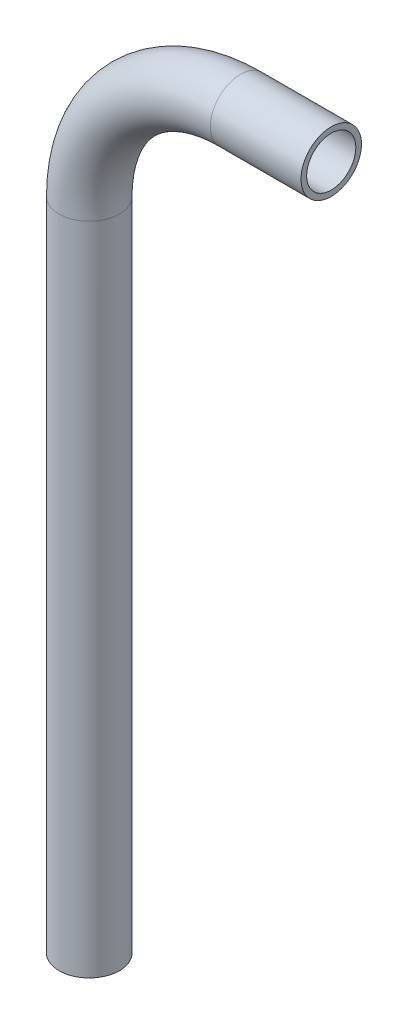
ISO-10303-21;
HEADER;
FILE_DESCRIPTION(('STEP AP214'),'2;1');
FILE_NAME('part.step','',(''),(''),'','','');
FILE_SCHEMA(('AUTOMOTIVE_DESIGN { 1 0 10303 214 1 1 1 1 }'));
ENDSEC;
DATA;
#1=APPLICATION_CONTEXT('core data for automotive mechanical design processes');
#2=APPLICATION_PROTOCOL_DEFINITION('international standard','automotive_design',2000,#1);
#3=PRODUCT_CONTEXT('',#1,'mechanical');
#4=PRODUCT('Part','Part','',(#3));
#5=PRODUCT_RELATED_PRODUCT_CATEGORY('part','',(#4));
#6=PRODUCT_DEFINITION_FORMATION('','',#4);
#7=PRODUCT_DEFINITION_CONTEXT('part definition',#1,'design');
#8=PRODUCT_DEFINITION('design','',#6,#7);
#9=PRODUCT_DEFINITION_SHAPE('','',#8);
#10=(LENGTH_UNIT() NAMED_UNIT(*) SI_UNIT(.MILLI.,.METRE.));
#11=(NAMED_UNIT(*) PLANE_ANGLE_UNIT() SI_UNIT($,.RADIAN.));
#12=(NAMED_UNIT(*) SI_UNIT($,.STERADIAN.) SOLID_ANGLE_UNIT());
#13=UNCERTAINTY_MEASURE_WITH_UNIT(LENGTH_MEASURE(1.E-05),#10,'distance_accuracy_value','');
#14=(GEOMETRIC_REPRESENTATION_CONTEXT(3) GLOBAL_UNCERTAINTY_ASSIGNED_CONTEXT((#13)) GLOBAL_UNIT_ASSIGNED_CONTEXT((#10,
#11,#12)) REPRESENTATION_CONTEXT('',''));
#15=CARTESIAN_POINT('',(0.,0.,0.));
#16=DIRECTION('',(0.,0.,1.));
#17=DIRECTION('',(1.,0.,0.));
#18=AXIS2_PLACEMENT_3D('',#15,#16,#17);
#19=CARTESIAN_POINT('',(0.,-127.,0.));
#20=DIRECTION('',(0.,1.,0.));
#21=DIRECTION('',(-1.,0.,0.));
#22=AXIS2_PLACEMENT_3D('',#19,#20,#21);
#23=CYLINDRICAL_SURFACE('',#22,4.7625);
#24=CARTESIAN_POINT('',(0.,-23.8125000000002,0.));
#25=DIRECTION('',(0.,1.,0.));
#26=DIRECTION('',(0.,0.,-1.));
#27=AXIS2_PLACEMENT_3D('',#24,#25,#26);
#28=CIRCLE('',#27,4.7625);
#29=CARTESIAN_POINT('',(-4.7625,-23.8125000000002,0.));
#30=VERTEX_POINT('',#29);
#31=EDGE_CURVE('E84',#30,#30,#28,.T.);
#32=ORIENTED_EDGE('',*,*,#31,.F.);
#33=EDGE_LOOP('',(#32));
#34=FACE_BOUND('',#33,.T.);
#35=CARTESIAN_POINT('',(0.,-127.,0.));
#36=DIRECTION('',(0.,1.,0.));
#37=DIRECTION('',(0.,0.,-1.));
#38=AXIS2_PLACEMENT_3D('',#35,#36,#37);
#39=CIRCLE('',#38,4.7625);
#40=CARTESIAN_POINT('',(0.,-127.,-4.7625));
#41=VERTEX_POINT('',#40);
#42=EDGE_CURVE('E53',#41,#41,#39,.T.);
#43=ORIENTED_EDGE('',*,*,#42,.T.);
#44=EDGE_LOOP('',(#43));
#45=FACE_BOUND('',#44,.T.);
#46=ADVANCED_FACE('F38',(#34,#45),#23,.T.);
#47=CARTESIAN_POINT('',(23.8125,-23.8125,0.));
#48=DIRECTION('',(0.,0.,-1.));
#49=DIRECTION('',(-1.,0.,0.));
#50=AXIS2_PLACEMENT_3D('',#47,#48,#49);
#51=TOROIDAL_SURFACE('',#50,23.8125,4.7625);
#52=CARTESIAN_POINT('',(23.8125000000002,2.66453525910038E-13,0.));
#53=DIRECTION('',(1.,0.,0.));
#54=DIRECTION('',(0.,0.,-1.));
#55=AXIS2_PLACEMENT_3D('',#52,#53,#54);
#56=CIRCLE('',#55,4.7625);
#57=CARTESIAN_POINT('',(23.8125000000002,4.7625,0.));
#58=VERTEX_POINT('',#57);
#59=EDGE_CURVE('E42',#58,#58,#56,.T.);
#60=CARTESIAN_POINT('',(23.8125,-23.8125,0.));
#61=DIRECTION('',(0.,0.,-1.));
#62=DIRECTION('',(-1.,0.,0.));
#63=AXIS2_PLACEMENT_3D('',#60,#61,#62);
#64=CIRCLE('',#63,28.575);
#65=EDGE_CURVE('',#30,#58,#64,.T.);
#66=ORIENTED_EDGE('',*,*,#31,.T.);
#67=ORIENTED_EDGE('',*,*,#59,.F.);
#68=ORIENTED_EDGE('',*,*,#65,.T.);
#69=ORIENTED_EDGE('',*,*,#65,.F.);
#70=EDGE_LOOP('',(#66,#68,#67,#69));
#71=FACE_BOUND('',#70,.T.);
#72=ADVANCED_FACE('F92',(#71),#51,.T.);
#73=CARTESIAN_POINT('',(23.8125000000002,0.,0.));
#74=DIRECTION('',(1.,0.,0.));
#75=DIRECTION('',(0.,0.,-1.));
#76=AXIS2_PLACEMENT_3D('',#73,#74,#75);
#77=CYLINDRICAL_SURFACE('',#76,4.7625);
#78=CARTESIAN_POINT('',(38.1,0.,0.));
#79=DIRECTION('',(1.,0.,0.));
#80=DIRECTION('',(0.,0.,-1.));
#81=AXIS2_PLACEMENT_3D('',#78,#79,#80);
#82=CIRCLE('',#81,4.7625);
#83=CARTESIAN_POINT('',(38.1,0.,-4.7625));
#84=VERTEX_POINT('',#83);
#85=EDGE_CURVE('E58',#84,#84,#82,.T.);
#86=ORIENTED_EDGE('',*,*,#85,.F.);
#87=EDGE_LOOP('',(#86));
#88=FACE_BOUND('',#87,.T.);
#89=ORIENTED_EDGE('',*,*,#59,.T.);
#90=EDGE_LOOP('',(#89));
#91=FACE_BOUND('',#90,.T.);
#92=ADVANCED_FACE('F40',(#88,#91),#77,.T.);
#93=CARTESIAN_POINT('',(0.,-127.,0.));
#94=DIRECTION('',(0.,1.,0.));
#95=DIRECTION('',(0.,0.,-1.));
#96=AXIS2_PLACEMENT_3D('',#93,#94,#95);
#97=PLANE('',#96);
#98=CARTESIAN_POINT('',(0.,-127.,0.));
#99=DIRECTION('',(0.,1.,0.));
#100=DIRECTION('',(0.,0.,-1.));
#101=AXIS2_PLACEMENT_3D('',#98,#99,#100);
#102=CIRCLE('',#101,3.8735);
#103=CARTESIAN_POINT('',(0.,-127.,-3.8735));
#104=VERTEX_POINT('',#103);
#105=EDGE_CURVE('E79',#104,#104,#102,.F.);
#106=ORIENTED_EDGE('',*,*,#105,.F.);
#107=EDGE_LOOP('',(#106));
#108=FACE_BOUND('',#107,.T.);
#109=ORIENTED_EDGE('',*,*,#42,.F.);
#110=EDGE_LOOP('',(#109));
#111=FACE_BOUND('',#110,.T.);
#112=ADVANCED_FACE('F98',(#108,#111),#97,.F.);
#113=CARTESIAN_POINT('',(38.1,0.,0.));
#114=DIRECTION('',(1.,0.,0.));
#115=DIRECTION('',(0.,0.,-1.));
#116=AXIS2_PLACEMENT_3D('',#113,#114,#115);
#117=PLANE('',#116);
#118=CARTESIAN_POINT('',(38.1,0.,0.));
#119=DIRECTION('',(1.,0.,0.));
#120=DIRECTION('',(0.,0.,-1.));
#121=AXIS2_PLACEMENT_3D('',#118,#119,#120);
#122=CIRCLE('',#121,3.8735);
#123=CARTESIAN_POINT('',(38.1,0.,-3.8735));
#124=VERTEX_POINT('',#123);
#125=EDGE_CURVE('E11',#124,#124,#122,.F.);
#126=ORIENTED_EDGE('',*,*,#125,.T.);
#127=EDGE_LOOP('',(#126));
#128=FACE_BOUND('',#127,.T.);
#129=ORIENTED_EDGE('',*,*,#85,.T.);
#130=EDGE_LOOP('',(#129));
#131=FACE_BOUND('',#130,.T.);
#132=ADVANCED_FACE('F65',(#128,#131),#117,.T.);
#133=CARTESIAN_POINT('',(0.,-127.,0.));
#134=DIRECTION('',(0.,1.,0.));
#135=DIRECTION('',(-1.,0.,0.));
#136=AXIS2_PLACEMENT_3D('',#133,#134,#135);
#137=CYLINDRICAL_SURFACE('',#136,3.8735);
#138=CARTESIAN_POINT('',(0.,-23.8125000000002,0.));
#139=DIRECTION('',(0.,1.,0.));
#140=DIRECTION('',(0.,0.,-1.));
#141=AXIS2_PLACEMENT_3D('',#138,#139,#140);
#142=CIRCLE('',#141,3.8735);
#143=CARTESIAN_POINT('',(-3.8735,-23.8125000000002,0.));
#144=VERTEX_POINT('',#143);
#145=EDGE_CURVE('E76',#144,#144,#142,.F.);
#146=ORIENTED_EDGE('',*,*,#145,.F.);
#147=EDGE_LOOP('',(#146));
#148=FACE_BOUND('',#147,.T.);
#149=ORIENTED_EDGE('',*,*,#105,.T.);
#150=EDGE_LOOP('',(#149));
#151=FACE_BOUND('',#150,.T.);
#152=ADVANCED_FACE('F106',(#148,#151),#137,.F.);
#153=CARTESIAN_POINT('',(23.8125,-23.8125,0.));
#154=DIRECTION('',(0.,0.,-1.));
#155=DIRECTION('',(-1.,0.,0.));
#156=AXIS2_PLACEMENT_3D('',#153,#154,#155);
#157=TOROIDAL_SURFACE('',#156,23.8125,3.8735);
#158=CARTESIAN_POINT('',(23.8125000000002,2.66453525910038E-13,0.));
#159=DIRECTION('',(1.,0.,0.));
#160=DIRECTION('',(0.,0.,-1.));
#161=AXIS2_PLACEMENT_3D('',#158,#159,#160);
#162=CIRCLE('',#161,3.8735);
#163=CARTESIAN_POINT('',(23.8125000000002,3.8735,0.));
#164=VERTEX_POINT('',#163);
#165=EDGE_CURVE('E47',#164,#164,#162,.F.);
#166=CARTESIAN_POINT('',(23.8125,-23.8125,0.));
#167=DIRECTION('',(0.,0.,-1.));
#168=DIRECTION('',(-1.,0.,0.));
#169=AXIS2_PLACEMENT_3D('',#166,#167,#168);
#170=CIRCLE('',#169,27.686);
#171=EDGE_CURVE('',#144,#164,#170,.T.);
#172=ORIENTED_EDGE('',*,*,#145,.T.);
#173=ORIENTED_EDGE('',*,*,#165,.F.);
#174=ORIENTED_EDGE('',*,*,#171,.T.);
#175=ORIENTED_EDGE('',*,*,#171,.F.);
#176=EDGE_LOOP('',(#172,#174,#173,#175));
#177=FACE_BOUND('',#176,.T.);
#178=ADVANCED_FACE('F71',(#177),#157,.F.);
#179=CARTESIAN_POINT('',(23.8125000000002,0.,0.));
#180=DIRECTION('',(1.,0.,0.));
#181=DIRECTION('',(0.,0.,-1.));
#182=AXIS2_PLACEMENT_3D('',#179,#180,#181);
#183=CYLINDRICAL_SURFACE('',#182,3.8735);
#184=ORIENTED_EDGE('',*,*,#125,.F.);
#185=EDGE_LOOP('',(#184));
#186=FACE_BOUND('',#185,.T.);
#187=ORIENTED_EDGE('',*,*,#165,.T.);
#188=EDGE_LOOP('',(#187));
#189=FACE_BOUND('',#188,.T.);
#190=ADVANCED_FACE('F68',(#186,#189),#183,.F.);
#191=CLOSED_SHELL('',(#46,#72,#92,#112,#132,#152,#178,#190));
#192=MANIFOLD_SOLID_BREP('B2',#191);
#193=ADVANCED_BREP_SHAPE_REPRESENTATION('',(#18,#192),#14);
#194=SHAPE_DEFINITION_REPRESENTATION(#9,#193);
ENDSEC;
END-ISO-10303-21;
